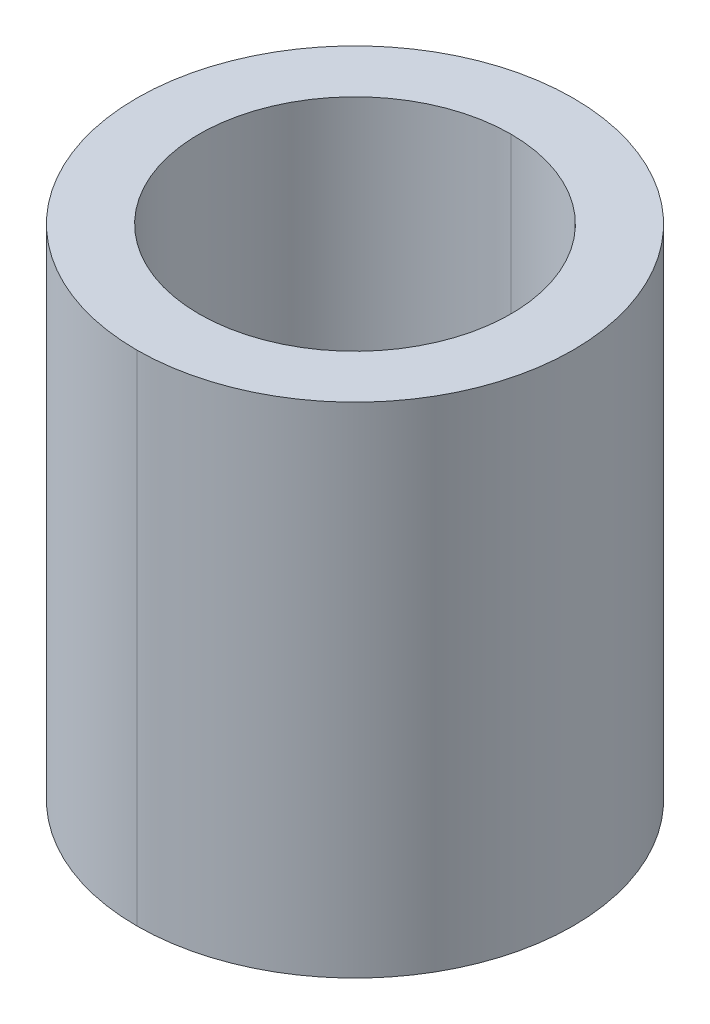
ISO-10303-21;
HEADER;
FILE_DESCRIPTION(('STEP AP214'),'2;1');
FILE_NAME('part.step','',(''),(''),'','','');
FILE_SCHEMA(('AUTOMOTIVE_DESIGN { 1 0 10303 214 1 1 1 1 }'));
ENDSEC;
DATA;
#1=APPLICATION_CONTEXT('core data for automotive mechanical design processes');
#2=APPLICATION_PROTOCOL_DEFINITION('international standard','automotive_design',2000,#1);
#3=PRODUCT_CONTEXT('',#1,'mechanical');
#4=PRODUCT('Part','Part','',(#3));
#5=PRODUCT_RELATED_PRODUCT_CATEGORY('part','',(#4));
#6=PRODUCT_DEFINITION_FORMATION('','',#4);
#7=PRODUCT_DEFINITION_CONTEXT('part definition',#1,'design');
#8=PRODUCT_DEFINITION('design','',#6,#7);
#9=PRODUCT_DEFINITION_SHAPE('','',#8);
#10=(LENGTH_UNIT() NAMED_UNIT(*) SI_UNIT(.MILLI.,.METRE.));
#11=(NAMED_UNIT(*) PLANE_ANGLE_UNIT() SI_UNIT($,.RADIAN.));
#12=(NAMED_UNIT(*) SI_UNIT($,.STERADIAN.) SOLID_ANGLE_UNIT());
#13=UNCERTAINTY_MEASURE_WITH_UNIT(LENGTH_MEASURE(1.E-05),#10,'distance_accuracy_value','');
#14=(GEOMETRIC_REPRESENTATION_CONTEXT(3) GLOBAL_UNCERTAINTY_ASSIGNED_CONTEXT((#13)) GLOBAL_UNIT_ASSIGNED_CONTEXT((#10,
#11,#12)) REPRESENTATION_CONTEXT('',''));
#15=CARTESIAN_POINT('',(0.,0.,0.));
#16=DIRECTION('',(0.,0.,1.));
#17=DIRECTION('',(1.,0.,0.));
#18=AXIS2_PLACEMENT_3D('',#15,#16,#17);
#19=CARTESIAN_POINT('',(0.,8.,0.));
#20=DIRECTION('',(0.,-1.,0.));
#21=DIRECTION('',(0.,0.,-1.));
#22=AXIS2_PLACEMENT_3D('',#19,#20,#21);
#23=CYLINDRICAL_SURFACE('',#22,2.5);
#24=DIRECTION('',(0.,-1.,0.));
#25=VECTOR('',#24,1.);
#26=CARTESIAN_POINT('',(0.,8.,2.5));
#27=LINE('',#26,#25);
#28=CARTESIAN_POINT('',(0.,8.,2.5));
#29=VERTEX_POINT('',#28);
#30=CARTESIAN_POINT('',(0.,0.,2.5));
#31=VERTEX_POINT('',#30);
#32=EDGE_CURVE('E262',#29,#31,#27,.T.);
#33=ORIENTED_EDGE('',*,*,#32,.F.);
#34=CARTESIAN_POINT('',(0.,8.,0.));
#35=DIRECTION('',(0.,1.,0.));
#36=DIRECTION('',(0.,0.,1.));
#37=AXIS2_PLACEMENT_3D('',#34,#35,#36);
#38=CIRCLE('',#37,2.5);
#39=CARTESIAN_POINT('',(0.,8.,-2.5));
#40=VERTEX_POINT('',#39);
#41=EDGE_CURVE('E74',#29,#40,#38,.T.);
#42=ORIENTED_EDGE('',*,*,#41,.T.);
#43=DIRECTION('',(0.,-1.,0.));
#44=VECTOR('',#43,1.);
#45=CARTESIAN_POINT('',(0.,8.,-2.5));
#46=LINE('',#45,#44);
#47=CARTESIAN_POINT('',(0.,0.,-2.5));
#48=VERTEX_POINT('',#47);
#49=EDGE_CURVE('E84',#40,#48,#46,.T.);
#50=ORIENTED_EDGE('',*,*,#49,.T.);
#51=CARTESIAN_POINT('',(0.,0.,0.));
#52=DIRECTION('',(0.,1.,0.));
#53=DIRECTION('',(0.,0.,1.));
#54=AXIS2_PLACEMENT_3D('',#51,#52,#53);
#55=CIRCLE('',#54,2.5);
#56=EDGE_CURVE('E10',#31,#48,#55,.T.);
#57=ORIENTED_EDGE('',*,*,#56,.F.);
#58=EDGE_LOOP('',(#33,#42,#50,#57));
#59=FACE_BOUND('',#58,.T.);
#60=ADVANCED_FACE('F16',(#59),#23,.F.);
#61=CARTESIAN_POINT('',(0.,8.,0.));
#62=DIRECTION('',(0.,-1.,0.));
#63=DIRECTION('',(0.,0.,-1.));
#64=AXIS2_PLACEMENT_3D('',#61,#62,#63);
#65=CYLINDRICAL_SURFACE('',#64,3.5);
#66=DIRECTION('',(0.,-1.,0.));
#67=VECTOR('',#66,1.);
#68=CARTESIAN_POINT('',(0.,8.,3.5));
#69=LINE('',#68,#67);
#70=CARTESIAN_POINT('',(0.,8.,3.5));
#71=VERTEX_POINT('',#70);
#72=CARTESIAN_POINT('',(0.,0.,3.5));
#73=VERTEX_POINT('',#72);
#74=EDGE_CURVE('E69',#71,#73,#69,.T.);
#75=ORIENTED_EDGE('',*,*,#74,.F.);
#76=CARTESIAN_POINT('',(0.,8.,0.));
#77=DIRECTION('',(0.,1.,0.));
#78=DIRECTION('',(0.,0.,1.));
#79=AXIS2_PLACEMENT_3D('',#76,#77,#78);
#80=CIRCLE('',#79,3.5);
#81=CARTESIAN_POINT('',(0.,8.,-3.5));
#82=VERTEX_POINT('',#81);
#83=EDGE_CURVE('E63',#82,#71,#80,.T.);
#84=ORIENTED_EDGE('',*,*,#83,.F.);
#85=DIRECTION('',(0.,-1.,0.));
#86=VECTOR('',#85,1.);
#87=CARTESIAN_POINT('',(0.,8.,-3.5));
#88=LINE('',#87,#86);
#89=CARTESIAN_POINT('',(0.,0.,-3.5));
#90=VERTEX_POINT('',#89);
#91=EDGE_CURVE('E66',#82,#90,#88,.T.);
#92=ORIENTED_EDGE('',*,*,#91,.T.);
#93=CARTESIAN_POINT('',(0.,0.,0.));
#94=DIRECTION('',(0.,1.,0.));
#95=DIRECTION('',(0.,0.,1.));
#96=AXIS2_PLACEMENT_3D('',#93,#94,#95);
#97=CIRCLE('',#96,3.5);
#98=EDGE_CURVE('E19',#90,#73,#97,.T.);
#99=ORIENTED_EDGE('',*,*,#98,.T.);
#100=EDGE_LOOP('',(#75,#84,#92,#99));
#101=FACE_BOUND('',#100,.T.);
#102=ADVANCED_FACE('F65',(#101),#65,.T.);
#103=CARTESIAN_POINT('',(0.,0.,0.));
#104=DIRECTION('',(0.,1.,0.));
#105=DIRECTION('',(1.,0.,0.));
#106=AXIS2_PLACEMENT_3D('',#103,#104,#105);
#107=PLANE('',#106);
#108=CARTESIAN_POINT('',(0.,0.,0.));
#109=DIRECTION('',(0.,1.,0.));
#110=DIRECTION('',(0.,0.,1.));
#111=AXIS2_PLACEMENT_3D('',#108,#109,#110);
#112=CIRCLE('',#111,2.5);
#113=EDGE_CURVE('E92',#48,#31,#112,.T.);
#114=ORIENTED_EDGE('',*,*,#113,.T.);
#115=ORIENTED_EDGE('',*,*,#56,.T.);
#116=EDGE_LOOP('',(#114,#115));
#117=FACE_BOUND('',#116,.T.);
#118=ORIENTED_EDGE('',*,*,#98,.F.);
#119=CARTESIAN_POINT('',(0.,0.,0.));
#120=DIRECTION('',(0.,1.,0.));
#121=DIRECTION('',(0.,0.,1.));
#122=AXIS2_PLACEMENT_3D('',#119,#120,#121);
#123=CIRCLE('',#122,3.5);
#124=EDGE_CURVE('E79',#73,#90,#123,.T.);
#125=ORIENTED_EDGE('',*,*,#124,.F.);
#126=EDGE_LOOP('',(#118,#125));
#127=FACE_BOUND('',#126,.T.);
#128=ADVANCED_FACE('F116',(#117,#127),#107,.F.);
#129=CARTESIAN_POINT('',(0.,8.,0.));
#130=DIRECTION('',(0.,1.,0.));
#131=DIRECTION('',(1.,0.,0.));
#132=AXIS2_PLACEMENT_3D('',#129,#130,#131);
#133=PLANE('',#132);
#134=CARTESIAN_POINT('',(0.,8.,0.));
#135=DIRECTION('',(0.,1.,0.));
#136=DIRECTION('',(0.,0.,1.));
#137=AXIS2_PLACEMENT_3D('',#134,#135,#136);
#138=CIRCLE('',#137,2.5);
#139=EDGE_CURVE('E265',#40,#29,#138,.T.);
#140=ORIENTED_EDGE('',*,*,#139,.F.);
#141=ORIENTED_EDGE('',*,*,#41,.F.);
#142=EDGE_LOOP('',(#140,#141));
#143=FACE_BOUND('',#142,.T.);
#144=ORIENTED_EDGE('',*,*,#83,.T.);
#145=CARTESIAN_POINT('',(0.,8.,0.));
#146=DIRECTION('',(0.,1.,0.));
#147=DIRECTION('',(0.,0.,1.));
#148=AXIS2_PLACEMENT_3D('',#145,#146,#147);
#149=CIRCLE('',#148,3.5);
#150=EDGE_CURVE('E78',#71,#82,#149,.T.);
#151=ORIENTED_EDGE('',*,*,#150,.T.);
#152=EDGE_LOOP('',(#144,#151));
#153=FACE_BOUND('',#152,.T.);
#154=ADVANCED_FACE('F82',(#143,#153),#133,.T.);
#155=CARTESIAN_POINT('',(0.,8.,0.));
#156=DIRECTION('',(0.,-1.,0.));
#157=DIRECTION('',(0.,0.,-1.));
#158=AXIS2_PLACEMENT_3D('',#155,#156,#157);
#159=CYLINDRICAL_SURFACE('',#158,3.5);
#160=ORIENTED_EDGE('',*,*,#150,.F.);
#161=ORIENTED_EDGE('',*,*,#74,.T.);
#162=ORIENTED_EDGE('',*,*,#124,.T.);
#163=ORIENTED_EDGE('',*,*,#91,.F.);
#164=EDGE_LOOP('',(#160,#161,#162,#163));
#165=FACE_BOUND('',#164,.T.);
#166=ADVANCED_FACE('F77',(#165),#159,.T.);
#167=CARTESIAN_POINT('',(0.,8.,0.));
#168=DIRECTION('',(0.,-1.,0.));
#169=DIRECTION('',(0.,0.,-1.));
#170=AXIS2_PLACEMENT_3D('',#167,#168,#169);
#171=CYLINDRICAL_SURFACE('',#170,2.5);
#172=ORIENTED_EDGE('',*,*,#139,.T.);
#173=ORIENTED_EDGE('',*,*,#32,.T.);
#174=ORIENTED_EDGE('',*,*,#113,.F.);
#175=ORIENTED_EDGE('',*,*,#49,.F.);
#176=EDGE_LOOP('',(#172,#173,#174,#175));
#177=FACE_BOUND('',#176,.T.);
#178=ADVANCED_FACE('F126',(#177),#171,.F.);
#179=CLOSED_SHELL('',(#60,#102,#128,#154,#166,#178));
#180=MANIFOLD_SOLID_BREP('B1',#179);
#181=ADVANCED_BREP_SHAPE_REPRESENTATION('',(#18,#180),#14);
#182=SHAPE_DEFINITION_REPRESENTATION(#9,#181);
ENDSEC;
END-ISO-10303-21;
